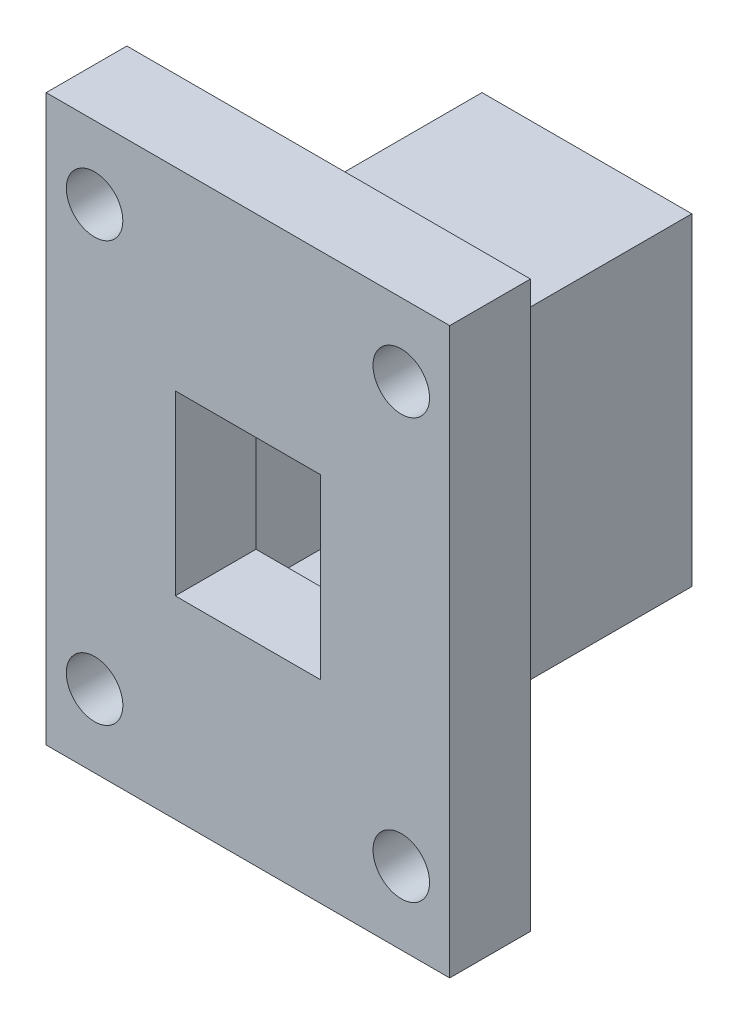
ISO-10303-21;
HEADER;
FILE_DESCRIPTION(('STEP AP214'),'2;1');
FILE_NAME('part.step','',(''),(''),'','','');
FILE_SCHEMA(('AUTOMOTIVE_DESIGN { 1 0 10303 214 1 1 1 1 }'));
ENDSEC;
DATA;
#1=APPLICATION_CONTEXT('core data for automotive mechanical design processes');
#2=APPLICATION_PROTOCOL_DEFINITION('international standard','automotive_design',2000,#1);
#3=PRODUCT_CONTEXT('',#1,'mechanical');
#4=PRODUCT('Part','Part','',(#3));
#5=PRODUCT_RELATED_PRODUCT_CATEGORY('part','',(#4));
#6=PRODUCT_DEFINITION_FORMATION('','',#4);
#7=PRODUCT_DEFINITION_CONTEXT('part definition',#1,'design');
#8=PRODUCT_DEFINITION('design','',#6,#7);
#9=PRODUCT_DEFINITION_SHAPE('','',#8);
#10=(LENGTH_UNIT() NAMED_UNIT(*) SI_UNIT(.MILLI.,.METRE.));
#11=(NAMED_UNIT(*) PLANE_ANGLE_UNIT() SI_UNIT($,.RADIAN.));
#12=(NAMED_UNIT(*) SI_UNIT($,.STERADIAN.) SOLID_ANGLE_UNIT());
#13=UNCERTAINTY_MEASURE_WITH_UNIT(LENGTH_MEASURE(1.E-05),#10,'distance_accuracy_value','');
#14=(GEOMETRIC_REPRESENTATION_CONTEXT(3) GLOBAL_UNCERTAINTY_ASSIGNED_CONTEXT((#13)) GLOBAL_UNIT_ASSIGNED_CONTEXT((#10,
#11,#12)) REPRESENTATION_CONTEXT('',''));
#15=CARTESIAN_POINT('',(0.,0.,0.));
#16=DIRECTION('',(0.,0.,1.));
#17=DIRECTION('',(1.,0.,0.));
#18=AXIS2_PLACEMENT_3D('',#15,#16,#17);
#19=CARTESIAN_POINT('',(0.,0.,0.));
#20=DIRECTION('',(0.,0.,-1.));
#21=DIRECTION('',(-1.,0.,0.));
#22=AXIS2_PLACEMENT_3D('',#19,#20,#21);
#23=PLANE('',#22);
#24=CARTESIAN_POINT('',(3.,4.5,0.));
#25=DIRECTION('',(0.,0.,1.));
#26=DIRECTION('',(-1.,0.,0.));
#27=AXIS2_PLACEMENT_3D('',#24,#25,#26);
#28=CIRCLE('',#27,1.75);
#29=CARTESIAN_POINT('',(1.25,4.5,0.));
#30=VERTEX_POINT('',#29);
#31=EDGE_CURVE('E214',#30,#30,#28,.T.);
#32=ORIENTED_EDGE('',*,*,#31,.T.);
#33=EDGE_LOOP('',(#32));
#34=FACE_BOUND('',#33,.T.);
#35=CARTESIAN_POINT('',(22.,4.5,0.));
#36=DIRECTION('',(0.,0.,1.));
#37=DIRECTION('',(1.,0.,0.));
#38=AXIS2_PLACEMENT_3D('',#35,#36,#37);
#39=CIRCLE('',#38,1.75);
#40=CARTESIAN_POINT('',(23.75,4.5,0.));
#41=VERTEX_POINT('',#40);
#42=EDGE_CURVE('E221',#41,#41,#39,.T.);
#43=ORIENTED_EDGE('',*,*,#42,.T.);
#44=EDGE_LOOP('',(#43));
#45=FACE_BOUND('',#44,.T.);
#46=CARTESIAN_POINT('',(22.,30.5,0.));
#47=DIRECTION('',(0.,0.,1.));
#48=DIRECTION('',(-1.,0.,0.));
#49=AXIS2_PLACEMENT_3D('',#46,#47,#48);
#50=CIRCLE('',#49,1.75);
#51=CARTESIAN_POINT('',(20.25,30.5,0.));
#52=VERTEX_POINT('',#51);
#53=EDGE_CURVE('E227',#52,#52,#50,.T.);
#54=ORIENTED_EDGE('',*,*,#53,.T.);
#55=EDGE_LOOP('',(#54));
#56=FACE_BOUND('',#55,.T.);
#57=CARTESIAN_POINT('',(3.,30.5,0.));
#58=DIRECTION('',(0.,0.,1.));
#59=DIRECTION('',(1.,0.,0.));
#60=AXIS2_PLACEMENT_3D('',#57,#58,#59);
#61=CIRCLE('',#60,1.75);
#62=CARTESIAN_POINT('',(4.75,30.5,0.));
#63=VERTEX_POINT('',#62);
#64=EDGE_CURVE('E232',#63,#63,#61,.T.);
#65=ORIENTED_EDGE('',*,*,#64,.T.);
#66=EDGE_LOOP('',(#65));
#67=FACE_BOUND('',#66,.T.);
#68=DIRECTION('',(0.,-1.,0.));
#69=VECTOR('',#68,1.);
#70=CARTESIAN_POINT('',(0.,0.,0.));
#71=LINE('',#70,#69);
#72=CARTESIAN_POINT('',(0.,35.,0.));
#73=VERTEX_POINT('',#72);
#74=CARTESIAN_POINT('',(0.,0.,0.));
#75=VERTEX_POINT('',#74);
#76=EDGE_CURVE('E263',#73,#75,#71,.T.);
#77=ORIENTED_EDGE('',*,*,#76,.F.);
#78=DIRECTION('',(-1.,0.,0.));
#79=VECTOR('',#78,1.);
#80=CARTESIAN_POINT('',(0.,35.,0.));
#81=LINE('',#80,#79);
#82=CARTESIAN_POINT('',(25.,35.,0.));
#83=VERTEX_POINT('',#82);
#84=EDGE_CURVE('E274',#83,#73,#81,.T.);
#85=ORIENTED_EDGE('',*,*,#84,.F.);
#86=DIRECTION('',(0.,1.,0.));
#87=VECTOR('',#86,1.);
#88=CARTESIAN_POINT('',(25.,0.,0.));
#89=LINE('',#88,#87);
#90=CARTESIAN_POINT('',(25.,0.,0.));
#91=VERTEX_POINT('',#90);
#92=EDGE_CURVE('E285',#91,#83,#89,.T.);
#93=ORIENTED_EDGE('',*,*,#92,.F.);
#94=DIRECTION('',(1.,0.,0.));
#95=VECTOR('',#94,1.);
#96=CARTESIAN_POINT('',(0.,0.,0.));
#97=LINE('',#96,#95);
#98=EDGE_CURVE('E283',#75,#91,#97,.T.);
#99=ORIENTED_EDGE('',*,*,#98,.F.);
#100=EDGE_LOOP('',(#77,#85,#93,#99));
#101=FACE_BOUND('',#100,.T.);
#102=DIRECTION('',(-1.,0.,0.));
#103=VECTOR('',#102,1.);
#104=CARTESIAN_POINT('',(19.,7.5,0.));
#105=LINE('',#104,#103);
#106=CARTESIAN_POINT('',(19.,7.5,0.));
#107=VERTEX_POINT('',#106);
#108=CARTESIAN_POINT('',(6.,7.5,0.));
#109=VERTEX_POINT('',#108);
#110=EDGE_CURVE('E200',#107,#109,#105,.T.);
#111=ORIENTED_EDGE('',*,*,#110,.F.);
#112=DIRECTION('',(0.,-1.,0.));
#113=VECTOR('',#112,1.);
#114=CARTESIAN_POINT('',(19.,27.5,0.));
#115=LINE('',#114,#113);
#116=CARTESIAN_POINT('',(19.,27.5,0.));
#117=VERTEX_POINT('',#116);
#118=EDGE_CURVE('E165',#117,#107,#115,.T.);
#119=ORIENTED_EDGE('',*,*,#118,.F.);
#120=DIRECTION('',(1.,0.,0.));
#121=VECTOR('',#120,1.);
#122=CARTESIAN_POINT('',(19.,27.5,0.));
#123=LINE('',#122,#121);
#124=CARTESIAN_POINT('',(6.,27.5,0.));
#125=VERTEX_POINT('',#124);
#126=EDGE_CURVE('E191',#125,#117,#123,.T.);
#127=ORIENTED_EDGE('',*,*,#126,.F.);
#128=DIRECTION('',(0.,1.,0.));
#129=VECTOR('',#128,1.);
#130=CARTESIAN_POINT('',(6.,27.5,0.));
#131=LINE('',#130,#129);
#132=EDGE_CURVE('E202',#109,#125,#131,.T.);
#133=ORIENTED_EDGE('',*,*,#132,.F.);
#134=EDGE_LOOP('',(#111,#119,#127,#133));
#135=FACE_BOUND('',#134,.T.);
#136=ADVANCED_FACE('F33',(#34,#45,#56,#67,#101,#135),#23,.T.);
#137=CARTESIAN_POINT('',(0.,0.,5.));
#138=DIRECTION('',(1.,0.,0.));
#139=DIRECTION('',(0.,0.,-1.));
#140=AXIS2_PLACEMENT_3D('',#137,#138,#139);
#141=PLANE('',#140);
#142=ORIENTED_EDGE('',*,*,#76,.T.);
#143=DIRECTION('',(0.,0.,-1.));
#144=VECTOR('',#143,1.);
#145=CARTESIAN_POINT('',(0.,0.,5.));
#146=LINE('',#145,#144);
#147=CARTESIAN_POINT('',(0.,0.,5.));
#148=VERTEX_POINT('',#147);
#149=EDGE_CURVE('E11',#148,#75,#146,.T.);
#150=ORIENTED_EDGE('',*,*,#149,.F.);
#151=DIRECTION('',(0.,-1.,0.));
#152=VECTOR('',#151,1.);
#153=CARTESIAN_POINT('',(0.,0.,5.));
#154=LINE('',#153,#152);
#155=CARTESIAN_POINT('',(0.,35.,5.));
#156=VERTEX_POINT('',#155);
#157=EDGE_CURVE('E270',#156,#148,#154,.T.);
#158=ORIENTED_EDGE('',*,*,#157,.F.);
#159=DIRECTION('',(0.,0.,-1.));
#160=VECTOR('',#159,1.);
#161=CARTESIAN_POINT('',(0.,35.,5.));
#162=LINE('',#161,#160);
#163=EDGE_CURVE('E280',#156,#73,#162,.T.);
#164=ORIENTED_EDGE('',*,*,#163,.T.);
#165=EDGE_LOOP('',(#142,#150,#158,#164));
#166=FACE_BOUND('',#165,.T.);
#167=ADVANCED_FACE('F35',(#166),#141,.F.);
#168=CARTESIAN_POINT('',(0.,0.,5.));
#169=DIRECTION('',(0.,1.,0.));
#170=DIRECTION('',(0.,0.,1.));
#171=AXIS2_PLACEMENT_3D('',#168,#169,#170);
#172=PLANE('',#171);
#173=ORIENTED_EDGE('',*,*,#98,.T.);
#174=DIRECTION('',(0.,0.,-1.));
#175=VECTOR('',#174,1.);
#176=CARTESIAN_POINT('',(25.,0.,5.));
#177=LINE('',#176,#175);
#178=CARTESIAN_POINT('',(25.,0.,5.));
#179=VERTEX_POINT('',#178);
#180=EDGE_CURVE('E41',#179,#91,#177,.T.);
#181=ORIENTED_EDGE('',*,*,#180,.F.);
#182=DIRECTION('',(1.,0.,0.));
#183=VECTOR('',#182,1.);
#184=CARTESIAN_POINT('',(0.,0.,5.));
#185=LINE('',#184,#183);
#186=EDGE_CURVE('E273',#148,#179,#185,.T.);
#187=ORIENTED_EDGE('',*,*,#186,.F.);
#188=ORIENTED_EDGE('',*,*,#149,.T.);
#189=EDGE_LOOP('',(#173,#181,#187,#188));
#190=FACE_BOUND('',#189,.T.);
#191=ADVANCED_FACE('F313',(#190),#172,.F.);
#192=CARTESIAN_POINT('',(25.,0.,5.));
#193=DIRECTION('',(-1.,0.,0.));
#194=DIRECTION('',(0.,0.,1.));
#195=AXIS2_PLACEMENT_3D('',#192,#193,#194);
#196=PLANE('',#195);
#197=ORIENTED_EDGE('',*,*,#92,.T.);
#198=DIRECTION('',(0.,0.,-1.));
#199=VECTOR('',#198,1.);
#200=CARTESIAN_POINT('',(25.,35.,5.));
#201=LINE('',#200,#199);
#202=CARTESIAN_POINT('',(25.,35.,5.));
#203=VERTEX_POINT('',#202);
#204=EDGE_CURVE('E290',#203,#83,#201,.T.);
#205=ORIENTED_EDGE('',*,*,#204,.F.);
#206=DIRECTION('',(0.,1.,0.));
#207=VECTOR('',#206,1.);
#208=CARTESIAN_POINT('',(25.,0.,5.));
#209=LINE('',#208,#207);
#210=EDGE_CURVE('E276',#179,#203,#209,.T.);
#211=ORIENTED_EDGE('',*,*,#210,.F.);
#212=ORIENTED_EDGE('',*,*,#180,.T.);
#213=EDGE_LOOP('',(#197,#205,#211,#212));
#214=FACE_BOUND('',#213,.T.);
#215=ADVANCED_FACE('F297',(#214),#196,.F.);
#216=CARTESIAN_POINT('',(0.,35.,5.));
#217=DIRECTION('',(0.,-1.,0.));
#218=DIRECTION('',(0.,0.,-1.));
#219=AXIS2_PLACEMENT_3D('',#216,#217,#218);
#220=PLANE('',#219);
#221=ORIENTED_EDGE('',*,*,#84,.T.);
#222=ORIENTED_EDGE('',*,*,#163,.F.);
#223=DIRECTION('',(-1.,0.,0.));
#224=VECTOR('',#223,1.);
#225=CARTESIAN_POINT('',(0.,35.,5.));
#226=LINE('',#225,#224);
#227=EDGE_CURVE('E278',#203,#156,#226,.T.);
#228=ORIENTED_EDGE('',*,*,#227,.F.);
#229=ORIENTED_EDGE('',*,*,#204,.T.);
#230=EDGE_LOOP('',(#221,#222,#228,#229));
#231=FACE_BOUND('',#230,.T.);
#232=ADVANCED_FACE('F306',(#231),#220,.F.);
#233=CARTESIAN_POINT('',(0.,0.,5.));
#234=DIRECTION('',(0.,0.,-1.));
#235=DIRECTION('',(-1.,0.,0.));
#236=AXIS2_PLACEMENT_3D('',#233,#234,#235);
#237=PLANE('',#236);
#238=CARTESIAN_POINT('',(3.,4.5,5.));
#239=DIRECTION('',(0.,0.,1.));
#240=DIRECTION('',(-1.,0.,0.));
#241=AXIS2_PLACEMENT_3D('',#238,#239,#240);
#242=CIRCLE('',#241,1.75);
#243=CARTESIAN_POINT('',(1.25,4.5,5.));
#244=VERTEX_POINT('',#243);
#245=EDGE_CURVE('E218',#244,#244,#242,.T.);
#246=ORIENTED_EDGE('',*,*,#245,.F.);
#247=EDGE_LOOP('',(#246));
#248=FACE_BOUND('',#247,.T.);
#249=CARTESIAN_POINT('',(22.,4.5,5.));
#250=DIRECTION('',(0.,0.,1.));
#251=DIRECTION('',(1.,0.,0.));
#252=AXIS2_PLACEMENT_3D('',#249,#250,#251);
#253=CIRCLE('',#252,1.75);
#254=CARTESIAN_POINT('',(23.75,4.5,5.));
#255=VERTEX_POINT('',#254);
#256=EDGE_CURVE('E224',#255,#255,#253,.T.);
#257=ORIENTED_EDGE('',*,*,#256,.F.);
#258=EDGE_LOOP('',(#257));
#259=FACE_BOUND('',#258,.T.);
#260=CARTESIAN_POINT('',(22.,30.5,5.));
#261=DIRECTION('',(0.,0.,1.));
#262=DIRECTION('',(-1.,0.,0.));
#263=AXIS2_PLACEMENT_3D('',#260,#261,#262);
#264=CIRCLE('',#263,1.75);
#265=CARTESIAN_POINT('',(20.25,30.5,5.));
#266=VERTEX_POINT('',#265);
#267=EDGE_CURVE('E213',#266,#266,#264,.T.);
#268=ORIENTED_EDGE('',*,*,#267,.F.);
#269=EDGE_LOOP('',(#268));
#270=FACE_BOUND('',#269,.T.);
#271=CARTESIAN_POINT('',(3.,30.5,5.));
#272=DIRECTION('',(0.,0.,1.));
#273=DIRECTION('',(1.,0.,0.));
#274=AXIS2_PLACEMENT_3D('',#271,#272,#273);
#275=CIRCLE('',#274,1.75);
#276=CARTESIAN_POINT('',(4.75,30.5,5.));
#277=VERTEX_POINT('',#276);
#278=EDGE_CURVE('E217',#277,#277,#275,.T.);
#279=ORIENTED_EDGE('',*,*,#278,.F.);
#280=EDGE_LOOP('',(#279));
#281=FACE_BOUND('',#280,.T.);
#282=DIRECTION('',(1.,0.,0.));
#283=VECTOR('',#282,1.);
#284=CARTESIAN_POINT('',(8.,12.,5.));
#285=LINE('',#284,#283);
#286=CARTESIAN_POINT('',(8.,12.,5.));
#287=VERTEX_POINT('',#286);
#288=CARTESIAN_POINT('',(17.,12.,5.));
#289=VERTEX_POINT('',#288);
#290=EDGE_CURVE('E253',#287,#289,#285,.T.);
#291=ORIENTED_EDGE('',*,*,#290,.F.);
#292=DIRECTION('',(0.,-1.,0.));
#293=VECTOR('',#292,1.);
#294=CARTESIAN_POINT('',(8.,23.,5.));
#295=LINE('',#294,#293);
#296=CARTESIAN_POINT('',(8.,23.,5.));
#297=VERTEX_POINT('',#296);
#298=EDGE_CURVE('E235',#297,#287,#295,.T.);
#299=ORIENTED_EDGE('',*,*,#298,.F.);
#300=DIRECTION('',(-1.,0.,0.));
#301=VECTOR('',#300,1.);
#302=CARTESIAN_POINT('',(8.,23.,5.));
#303=LINE('',#302,#301);
#304=CARTESIAN_POINT('',(17.,23.,5.));
#305=VERTEX_POINT('',#304);
#306=EDGE_CURVE('E242',#305,#297,#303,.T.);
#307=ORIENTED_EDGE('',*,*,#306,.F.);
#308=DIRECTION('',(0.,1.,0.));
#309=VECTOR('',#308,1.);
#310=CARTESIAN_POINT('',(17.,23.,5.));
#311=LINE('',#310,#309);
#312=EDGE_CURVE('E256',#289,#305,#311,.T.);
#313=ORIENTED_EDGE('',*,*,#312,.F.);
#314=EDGE_LOOP('',(#291,#299,#307,#313));
#315=FACE_BOUND('',#314,.T.);
#316=ORIENTED_EDGE('',*,*,#157,.T.);
#317=ORIENTED_EDGE('',*,*,#186,.T.);
#318=ORIENTED_EDGE('',*,*,#210,.T.);
#319=ORIENTED_EDGE('',*,*,#227,.T.);
#320=EDGE_LOOP('',(#316,#317,#318,#319));
#321=FACE_BOUND('',#320,.T.);
#322=ADVANCED_FACE('F312',(#248,#259,#270,#281,#315,#321),#237,.F.);
#323=DIRECTION('',(0.,-1.,0.));
#324=VECTOR('',#323,1.);
#325=CARTESIAN_POINT('',(17.5,25.5,0.));
#326=LINE('',#325,#324);
#327=CARTESIAN_POINT('',(17.5,25.5,0.));
#328=VERTEX_POINT('',#327);
#329=CARTESIAN_POINT('',(17.5,9.5,0.));
#330=VERTEX_POINT('',#329);
#331=EDGE_CURVE('E56',#328,#330,#326,.T.);
#332=ORIENTED_EDGE('',*,*,#331,.T.);
#333=DIRECTION('',(-1.,0.,0.));
#334=VECTOR('',#333,1.);
#335=CARTESIAN_POINT('',(17.5,9.5,0.));
#336=LINE('',#335,#334);
#337=CARTESIAN_POINT('',(7.5,9.5,0.));
#338=VERTEX_POINT('',#337);
#339=EDGE_CURVE('E164',#330,#338,#336,.T.);
#340=ORIENTED_EDGE('',*,*,#339,.T.);
#341=DIRECTION('',(0.,1.,0.));
#342=VECTOR('',#341,1.);
#343=CARTESIAN_POINT('',(7.5,25.5,0.));
#344=LINE('',#343,#342);
#345=CARTESIAN_POINT('',(7.5,25.5,0.));
#346=VERTEX_POINT('',#345);
#347=EDGE_CURVE('E179',#338,#346,#344,.T.);
#348=ORIENTED_EDGE('',*,*,#347,.T.);
#349=DIRECTION('',(1.,0.,0.));
#350=VECTOR('',#349,1.);
#351=CARTESIAN_POINT('',(17.5,25.5,0.));
#352=LINE('',#351,#350);
#353=EDGE_CURVE('E158',#346,#328,#352,.T.);
#354=ORIENTED_EDGE('',*,*,#353,.T.);
#355=EDGE_LOOP('',(#332,#340,#348,#354));
#356=FACE_BOUND('',#355,.T.);
#357=DIRECTION('',(0.,-1.,0.));
#358=VECTOR('',#357,1.);
#359=CARTESIAN_POINT('',(8.,23.,0.));
#360=LINE('',#359,#358);
#361=CARTESIAN_POINT('',(8.,23.,0.));
#362=VERTEX_POINT('',#361);
#363=CARTESIAN_POINT('',(8.,12.,0.));
#364=VERTEX_POINT('',#363);
#365=EDGE_CURVE('E238',#362,#364,#360,.T.);
#366=ORIENTED_EDGE('',*,*,#365,.T.);
#367=DIRECTION('',(1.,0.,0.));
#368=VECTOR('',#367,1.);
#369=CARTESIAN_POINT('',(8.,12.,0.));
#370=LINE('',#369,#368);
#371=CARTESIAN_POINT('',(17.,12.,0.));
#372=VERTEX_POINT('',#371);
#373=EDGE_CURVE('E241',#364,#372,#370,.T.);
#374=ORIENTED_EDGE('',*,*,#373,.T.);
#375=DIRECTION('',(0.,1.,0.));
#376=VECTOR('',#375,1.);
#377=CARTESIAN_POINT('',(17.,23.,0.));
#378=LINE('',#377,#376);
#379=CARTESIAN_POINT('',(17.,23.,0.));
#380=VERTEX_POINT('',#379);
#381=EDGE_CURVE('E245',#372,#380,#378,.T.);
#382=ORIENTED_EDGE('',*,*,#381,.T.);
#383=DIRECTION('',(-1.,0.,0.));
#384=VECTOR('',#383,1.);
#385=CARTESIAN_POINT('',(8.,23.,0.));
#386=LINE('',#385,#384);
#387=EDGE_CURVE('E248',#380,#362,#386,.T.);
#388=ORIENTED_EDGE('',*,*,#387,.T.);
#389=EDGE_LOOP('',(#366,#374,#382,#388));
#390=FACE_BOUND('',#389,.T.);
#391=ADVANCED_FACE('F323',(#356,#390),#23,.T.);
#392=CARTESIAN_POINT('',(8.,23.,0.));
#393=DIRECTION('',(-1.,0.,0.));
#394=DIRECTION('',(0.,0.,1.));
#395=AXIS2_PLACEMENT_3D('',#392,#393,#394);
#396=PLANE('',#395);
#397=ORIENTED_EDGE('',*,*,#298,.T.);
#398=DIRECTION('',(0.,0.,1.));
#399=VECTOR('',#398,1.);
#400=CARTESIAN_POINT('',(8.,12.,0.));
#401=LINE('',#400,#399);
#402=EDGE_CURVE('E251',#364,#287,#401,.T.);
#403=ORIENTED_EDGE('',*,*,#402,.F.);
#404=ORIENTED_EDGE('',*,*,#365,.F.);
#405=DIRECTION('',(0.,0.,1.));
#406=VECTOR('',#405,1.);
#407=CARTESIAN_POINT('',(8.,23.,0.));
#408=LINE('',#407,#406);
#409=EDGE_CURVE('E261',#362,#297,#408,.T.);
#410=ORIENTED_EDGE('',*,*,#409,.T.);
#411=EDGE_LOOP('',(#397,#403,#404,#410));
#412=FACE_BOUND('',#411,.T.);
#413=ADVANCED_FACE('F330',(#412),#396,.F.);
#414=CARTESIAN_POINT('',(8.,23.,0.));
#415=DIRECTION('',(0.,1.,0.));
#416=DIRECTION('',(0.,0.,1.));
#417=AXIS2_PLACEMENT_3D('',#414,#415,#416);
#418=PLANE('',#417);
#419=ORIENTED_EDGE('',*,*,#306,.T.);
#420=ORIENTED_EDGE('',*,*,#409,.F.);
#421=ORIENTED_EDGE('',*,*,#387,.F.);
#422=DIRECTION('',(0.,0.,1.));
#423=VECTOR('',#422,1.);
#424=CARTESIAN_POINT('',(17.,23.,0.));
#425=LINE('',#424,#423);
#426=EDGE_CURVE('E264',#380,#305,#425,.T.);
#427=ORIENTED_EDGE('',*,*,#426,.T.);
#428=EDGE_LOOP('',(#419,#420,#421,#427));
#429=FACE_BOUND('',#428,.T.);
#430=ADVANCED_FACE('F335',(#429),#418,.F.);
#431=CARTESIAN_POINT('',(17.,23.,0.));
#432=DIRECTION('',(1.,0.,0.));
#433=DIRECTION('',(0.,0.,-1.));
#434=AXIS2_PLACEMENT_3D('',#431,#432,#433);
#435=PLANE('',#434);
#436=ORIENTED_EDGE('',*,*,#312,.T.);
#437=ORIENTED_EDGE('',*,*,#426,.F.);
#438=ORIENTED_EDGE('',*,*,#381,.F.);
#439=DIRECTION('',(0.,0.,1.));
#440=VECTOR('',#439,1.);
#441=CARTESIAN_POINT('',(17.,12.,0.));
#442=LINE('',#441,#440);
#443=EDGE_CURVE('E266',#372,#289,#442,.T.);
#444=ORIENTED_EDGE('',*,*,#443,.T.);
#445=EDGE_LOOP('',(#436,#437,#438,#444));
#446=FACE_BOUND('',#445,.T.);
#447=ADVANCED_FACE('F350',(#446),#435,.F.);
#448=CARTESIAN_POINT('',(8.,12.,0.));
#449=DIRECTION('',(0.,-1.,0.));
#450=DIRECTION('',(1.,0.,0.));
#451=AXIS2_PLACEMENT_3D('',#448,#449,#450);
#452=PLANE('',#451);
#453=ORIENTED_EDGE('',*,*,#290,.T.);
#454=ORIENTED_EDGE('',*,*,#443,.F.);
#455=ORIENTED_EDGE('',*,*,#373,.F.);
#456=ORIENTED_EDGE('',*,*,#402,.T.);
#457=EDGE_LOOP('',(#453,#454,#455,#456));
#458=FACE_BOUND('',#457,.T.);
#459=ADVANCED_FACE('F347',(#458),#452,.F.);
#460=CARTESIAN_POINT('',(3.,30.5,0.));
#461=DIRECTION('',(0.,0.,1.));
#462=DIRECTION('',(1.,0.,0.));
#463=AXIS2_PLACEMENT_3D('',#460,#461,#462);
#464=CYLINDRICAL_SURFACE('',#463,1.75);
#465=ORIENTED_EDGE('',*,*,#64,.F.);
#466=EDGE_LOOP('',(#465));
#467=FACE_BOUND('',#466,.T.);
#468=ORIENTED_EDGE('',*,*,#278,.T.);
#469=EDGE_LOOP('',(#468));
#470=FACE_BOUND('',#469,.T.);
#471=ADVANCED_FACE('F361',(#467,#470),#464,.F.);
#472=CARTESIAN_POINT('',(22.,30.5,0.));
#473=DIRECTION('',(0.,0.,1.));
#474=DIRECTION('',(1.,0.,0.));
#475=AXIS2_PLACEMENT_3D('',#472,#473,#474);
#476=CYLINDRICAL_SURFACE('',#475,1.75);
#477=ORIENTED_EDGE('',*,*,#53,.F.);
#478=EDGE_LOOP('',(#477));
#479=FACE_BOUND('',#478,.T.);
#480=ORIENTED_EDGE('',*,*,#267,.T.);
#481=EDGE_LOOP('',(#480));
#482=FACE_BOUND('',#481,.T.);
#483=ADVANCED_FACE('F368',(#479,#482),#476,.F.);
#484=CARTESIAN_POINT('',(22.,4.5,0.));
#485=DIRECTION('',(0.,0.,1.));
#486=DIRECTION('',(1.,0.,0.));
#487=AXIS2_PLACEMENT_3D('',#484,#485,#486);
#488=CYLINDRICAL_SURFACE('',#487,1.75);
#489=ORIENTED_EDGE('',*,*,#42,.F.);
#490=EDGE_LOOP('',(#489));
#491=FACE_BOUND('',#490,.T.);
#492=ORIENTED_EDGE('',*,*,#256,.T.);
#493=EDGE_LOOP('',(#492));
#494=FACE_BOUND('',#493,.T.);
#495=ADVANCED_FACE('F373',(#491,#494),#488,.F.);
#496=CARTESIAN_POINT('',(3.,4.5,0.));
#497=DIRECTION('',(0.,0.,1.));
#498=DIRECTION('',(1.,0.,0.));
#499=AXIS2_PLACEMENT_3D('',#496,#497,#498);
#500=CYLINDRICAL_SURFACE('',#499,1.75);
#501=ORIENTED_EDGE('',*,*,#31,.F.);
#502=EDGE_LOOP('',(#501));
#503=FACE_BOUND('',#502,.T.);
#504=ORIENTED_EDGE('',*,*,#245,.T.);
#505=EDGE_LOOP('',(#504));
#506=FACE_BOUND('',#505,.T.);
#507=ADVANCED_FACE('F383',(#503,#506),#500,.F.);
#508=CARTESIAN_POINT('',(0.,0.,-16.));
#509=DIRECTION('',(0.,0.,-1.));
#510=DIRECTION('',(-1.,0.,0.));
#511=AXIS2_PLACEMENT_3D('',#508,#509,#510);
#512=PLANE('',#511);
#513=DIRECTION('',(0.,-1.,0.));
#514=VECTOR('',#513,1.);
#515=CARTESIAN_POINT('',(19.,27.5,-16.));
#516=LINE('',#515,#514);
#517=CARTESIAN_POINT('',(19.,27.5,-16.));
#518=VERTEX_POINT('',#517);
#519=CARTESIAN_POINT('',(19.,7.5,-16.));
#520=VERTEX_POINT('',#519);
#521=EDGE_CURVE('E187',#518,#520,#516,.T.);
#522=ORIENTED_EDGE('',*,*,#521,.T.);
#523=DIRECTION('',(-1.,0.,0.));
#524=VECTOR('',#523,1.);
#525=CARTESIAN_POINT('',(19.,7.5,-16.));
#526=LINE('',#525,#524);
#527=CARTESIAN_POINT('',(6.,7.5,-16.));
#528=VERTEX_POINT('',#527);
#529=EDGE_CURVE('E190',#520,#528,#526,.T.);
#530=ORIENTED_EDGE('',*,*,#529,.T.);
#531=DIRECTION('',(0.,1.,0.));
#532=VECTOR('',#531,1.);
#533=CARTESIAN_POINT('',(6.,27.5,-16.));
#534=LINE('',#533,#532);
#535=CARTESIAN_POINT('',(6.,27.5,-16.));
#536=VERTEX_POINT('',#535);
#537=EDGE_CURVE('E193',#528,#536,#534,.T.);
#538=ORIENTED_EDGE('',*,*,#537,.T.);
#539=DIRECTION('',(1.,0.,0.));
#540=VECTOR('',#539,1.);
#541=CARTESIAN_POINT('',(19.,27.5,-16.));
#542=LINE('',#541,#540);
#543=EDGE_CURVE('E195',#536,#518,#542,.T.);
#544=ORIENTED_EDGE('',*,*,#543,.T.);
#545=EDGE_LOOP('',(#522,#530,#538,#544));
#546=FACE_BOUND('',#545,.T.);
#547=DIRECTION('',(-1.,0.,0.));
#548=VECTOR('',#547,1.);
#549=CARTESIAN_POINT('',(17.5,9.5,-16.));
#550=LINE('',#549,#548);
#551=CARTESIAN_POINT('',(17.5,9.5,-16.));
#552=VERTEX_POINT('',#551);
#553=CARTESIAN_POINT('',(7.5,9.5,-16.));
#554=VERTEX_POINT('',#553);
#555=EDGE_CURVE('E157',#552,#554,#550,.T.);
#556=ORIENTED_EDGE('',*,*,#555,.F.);
#557=DIRECTION('',(0.,-1.,0.));
#558=VECTOR('',#557,1.);
#559=CARTESIAN_POINT('',(17.5,25.5,-16.));
#560=LINE('',#559,#558);
#561=CARTESIAN_POINT('',(17.5,25.5,-16.));
#562=VERTEX_POINT('',#561);
#563=EDGE_CURVE('E148',#562,#552,#560,.T.);
#564=ORIENTED_EDGE('',*,*,#563,.F.);
#565=DIRECTION('',(1.,0.,0.));
#566=VECTOR('',#565,1.);
#567=CARTESIAN_POINT('',(17.5,25.5,-16.));
#568=LINE('',#567,#566);
#569=CARTESIAN_POINT('',(7.5,25.5,-16.));
#570=VERTEX_POINT('',#569);
#571=EDGE_CURVE('E173',#570,#562,#568,.T.);
#572=ORIENTED_EDGE('',*,*,#571,.F.);
#573=DIRECTION('',(0.,1.,0.));
#574=VECTOR('',#573,1.);
#575=CARTESIAN_POINT('',(7.5,25.5,-16.));
#576=LINE('',#575,#574);
#577=EDGE_CURVE('E171',#554,#570,#576,.T.);
#578=ORIENTED_EDGE('',*,*,#577,.F.);
#579=EDGE_LOOP('',(#556,#564,#572,#578));
#580=FACE_BOUND('',#579,.T.);
#581=ADVANCED_FACE('F169',(#546,#580),#512,.T.);
#582=CARTESIAN_POINT('',(19.,27.5,-16.));
#583=DIRECTION('',(-1.,0.,0.));
#584=DIRECTION('',(0.,0.,1.));
#585=AXIS2_PLACEMENT_3D('',#582,#583,#584);
#586=PLANE('',#585);
#587=ORIENTED_EDGE('',*,*,#118,.T.);
#588=DIRECTION('',(0.,0.,1.));
#589=VECTOR('',#588,1.);
#590=CARTESIAN_POINT('',(19.,7.5,-16.));
#591=LINE('',#590,#589);
#592=EDGE_CURVE('E211',#520,#107,#591,.T.);
#593=ORIENTED_EDGE('',*,*,#592,.F.);
#594=ORIENTED_EDGE('',*,*,#521,.F.);
#595=DIRECTION('',(0.,0.,1.));
#596=VECTOR('',#595,1.);
#597=CARTESIAN_POINT('',(19.,27.5,-16.));
#598=LINE('',#597,#596);
#599=EDGE_CURVE('E197',#518,#117,#598,.T.);
#600=ORIENTED_EDGE('',*,*,#599,.T.);
#601=EDGE_LOOP('',(#587,#593,#594,#600));
#602=FACE_BOUND('',#601,.T.);
#603=ADVANCED_FACE('F392',(#602),#586,.F.);
#604=CARTESIAN_POINT('',(19.,7.5,-16.));
#605=DIRECTION('',(0.,1.,0.));
#606=DIRECTION('',(-1.,0.,0.));
#607=AXIS2_PLACEMENT_3D('',#604,#605,#606);
#608=PLANE('',#607);
#609=ORIENTED_EDGE('',*,*,#110,.T.);
#610=DIRECTION('',(0.,0.,1.));
#611=VECTOR('',#610,1.);
#612=CARTESIAN_POINT('',(6.,7.5,-16.));
#613=LINE('',#612,#611);
#614=EDGE_CURVE('E208',#528,#109,#613,.T.);
#615=ORIENTED_EDGE('',*,*,#614,.F.);
#616=ORIENTED_EDGE('',*,*,#529,.F.);
#617=ORIENTED_EDGE('',*,*,#592,.T.);
#618=EDGE_LOOP('',(#609,#615,#616,#617));
#619=FACE_BOUND('',#618,.T.);
#620=ADVANCED_FACE('F395',(#619),#608,.F.);
#621=CARTESIAN_POINT('',(6.,27.5,-16.));
#622=DIRECTION('',(1.,0.,0.));
#623=DIRECTION('',(0.,1.,0.));
#624=AXIS2_PLACEMENT_3D('',#621,#622,#623);
#625=PLANE('',#624);
#626=ORIENTED_EDGE('',*,*,#132,.T.);
#627=DIRECTION('',(0.,0.,1.));
#628=VECTOR('',#627,1.);
#629=CARTESIAN_POINT('',(6.,27.5,-16.));
#630=LINE('',#629,#628);
#631=EDGE_CURVE('E48',#536,#125,#630,.T.);
#632=ORIENTED_EDGE('',*,*,#631,.F.);
#633=ORIENTED_EDGE('',*,*,#537,.F.);
#634=ORIENTED_EDGE('',*,*,#614,.T.);
#635=EDGE_LOOP('',(#626,#632,#633,#634));
#636=FACE_BOUND('',#635,.T.);
#637=ADVANCED_FACE('F399',(#636),#625,.F.);
#638=CARTESIAN_POINT('',(19.,27.5,-16.));
#639=DIRECTION('',(0.,-1.,0.));
#640=DIRECTION('',(0.,0.,-1.));
#641=AXIS2_PLACEMENT_3D('',#638,#639,#640);
#642=PLANE('',#641);
#643=ORIENTED_EDGE('',*,*,#126,.T.);
#644=ORIENTED_EDGE('',*,*,#599,.F.);
#645=ORIENTED_EDGE('',*,*,#543,.F.);
#646=ORIENTED_EDGE('',*,*,#631,.T.);
#647=EDGE_LOOP('',(#643,#644,#645,#646));
#648=FACE_BOUND('',#647,.T.);
#649=ADVANCED_FACE('F403',(#648),#642,.F.);
#650=CARTESIAN_POINT('',(17.5,25.5,-16.));
#651=DIRECTION('',(-1.,0.,0.));
#652=DIRECTION('',(0.,0.,1.));
#653=AXIS2_PLACEMENT_3D('',#650,#651,#652);
#654=PLANE('',#653);
#655=ORIENTED_EDGE('',*,*,#331,.F.);
#656=DIRECTION('',(0.,0.,1.));
#657=VECTOR('',#656,1.);
#658=CARTESIAN_POINT('',(17.5,25.5,-16.));
#659=LINE('',#658,#657);
#660=EDGE_CURVE('E153',#562,#328,#659,.T.);
#661=ORIENTED_EDGE('',*,*,#660,.F.);
#662=ORIENTED_EDGE('',*,*,#563,.T.);
#663=DIRECTION('',(0.,0.,1.));
#664=VECTOR('',#663,1.);
#665=CARTESIAN_POINT('',(17.5,9.5,-16.));
#666=LINE('',#665,#664);
#667=EDGE_CURVE('E151',#552,#330,#666,.T.);
#668=ORIENTED_EDGE('',*,*,#667,.T.);
#669=EDGE_LOOP('',(#655,#661,#662,#668));
#670=FACE_BOUND('',#669,.T.);
#671=ADVANCED_FACE('F150',(#670),#654,.T.);
#672=CARTESIAN_POINT('',(17.5,9.5,-16.));
#673=DIRECTION('',(0.,1.,0.));
#674=DIRECTION('',(0.,0.,1.));
#675=AXIS2_PLACEMENT_3D('',#672,#673,#674);
#676=PLANE('',#675);
#677=ORIENTED_EDGE('',*,*,#339,.F.);
#678=ORIENTED_EDGE('',*,*,#667,.F.);
#679=ORIENTED_EDGE('',*,*,#555,.T.);
#680=DIRECTION('',(0.,0.,1.));
#681=VECTOR('',#680,1.);
#682=CARTESIAN_POINT('',(7.5,9.5,-16.));
#683=LINE('',#682,#681);
#684=EDGE_CURVE('E166',#554,#338,#683,.T.);
#685=ORIENTED_EDGE('',*,*,#684,.T.);
#686=EDGE_LOOP('',(#677,#678,#679,#685));
#687=FACE_BOUND('',#686,.T.);
#688=ADVANCED_FACE('F161',(#687),#676,.T.);
#689=CARTESIAN_POINT('',(7.5,25.5,-16.));
#690=DIRECTION('',(1.,0.,0.));
#691=DIRECTION('',(0.,1.,0.));
#692=AXIS2_PLACEMENT_3D('',#689,#690,#691);
#693=PLANE('',#692);
#694=ORIENTED_EDGE('',*,*,#347,.F.);
#695=ORIENTED_EDGE('',*,*,#684,.F.);
#696=ORIENTED_EDGE('',*,*,#577,.T.);
#697=DIRECTION('',(0.,0.,1.));
#698=VECTOR('',#697,1.);
#699=CARTESIAN_POINT('',(7.5,25.5,-16.));
#700=LINE('',#699,#698);
#701=EDGE_CURVE('E183',#570,#346,#700,.T.);
#702=ORIENTED_EDGE('',*,*,#701,.T.);
#703=EDGE_LOOP('',(#694,#695,#696,#702));
#704=FACE_BOUND('',#703,.T.);
#705=ADVANCED_FACE('F414',(#704),#693,.T.);
#706=CARTESIAN_POINT('',(17.5,25.5,-16.));
#707=DIRECTION('',(0.,-1.,0.));
#708=DIRECTION('',(0.,0.,-1.));
#709=AXIS2_PLACEMENT_3D('',#706,#707,#708);
#710=PLANE('',#709);
#711=ORIENTED_EDGE('',*,*,#353,.F.);
#712=ORIENTED_EDGE('',*,*,#701,.F.);
#713=ORIENTED_EDGE('',*,*,#571,.T.);
#714=ORIENTED_EDGE('',*,*,#660,.T.);
#715=EDGE_LOOP('',(#711,#712,#713,#714));
#716=FACE_BOUND('',#715,.T.);
#717=ADVANCED_FACE('F417',(#716),#710,.T.);
#718=CLOSED_SHELL('',(#136,#167,#191,#215,#232,#322,#391,#413,#430,#447,#459,#471,#483,#495,
#507,#581,#603,#620,#637,#649,#671,#688,#705,#717));
#719=MANIFOLD_SOLID_BREP('B2',#718);
#720=ADVANCED_BREP_SHAPE_REPRESENTATION('',(#18,#719),#14);
#721=SHAPE_DEFINITION_REPRESENTATION(#9,#720);
ENDSEC;
END-ISO-10303-21;
